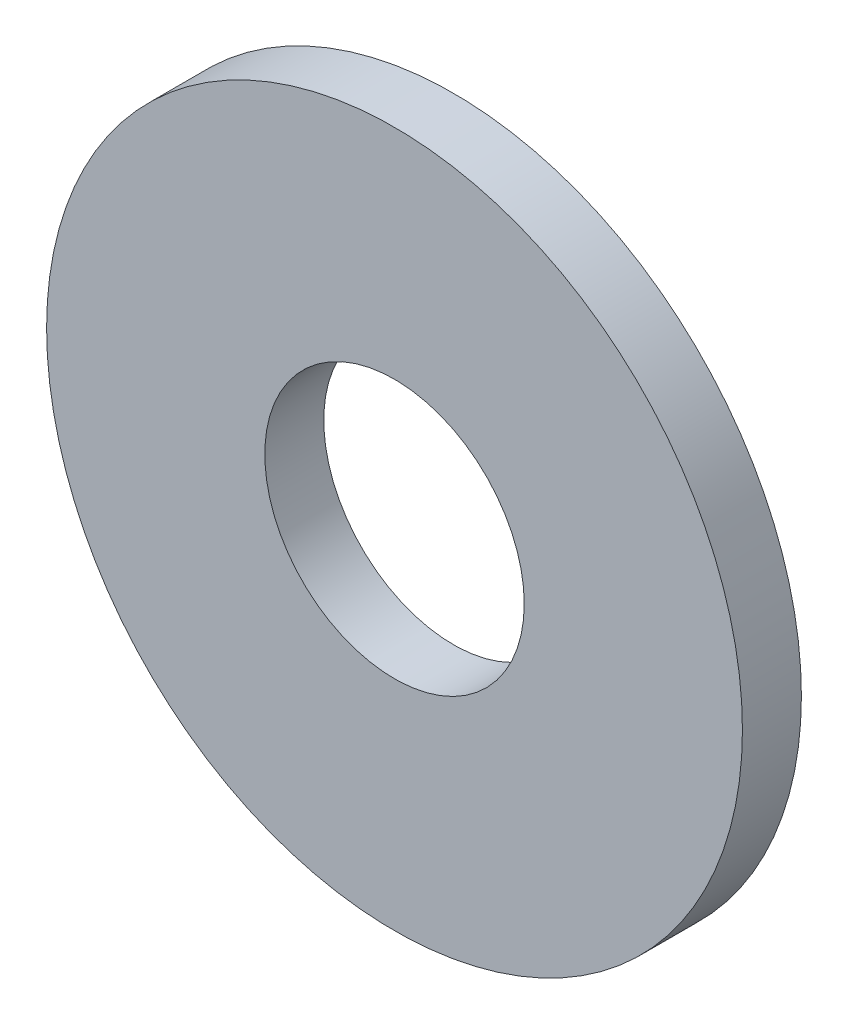
ISO-10303-21;
HEADER;
FILE_DESCRIPTION(('STEP AP214'),'2;1');
FILE_NAME('part.step','',(''),(''),'','','');
FILE_SCHEMA(('AUTOMOTIVE_DESIGN { 1 0 10303 214 1 1 1 1 }'));
ENDSEC;
DATA;
#1=APPLICATION_CONTEXT('core data for automotive mechanical design processes');
#2=APPLICATION_PROTOCOL_DEFINITION('international standard','automotive_design',2000,#1);
#3=PRODUCT_CONTEXT('',#1,'mechanical');
#4=PRODUCT('Part','Part','',(#3));
#5=PRODUCT_RELATED_PRODUCT_CATEGORY('part','',(#4));
#6=PRODUCT_DEFINITION_FORMATION('','',#4);
#7=PRODUCT_DEFINITION_CONTEXT('part definition',#1,'design');
#8=PRODUCT_DEFINITION('design','',#6,#7);
#9=PRODUCT_DEFINITION_SHAPE('','',#8);
#10=(LENGTH_UNIT() NAMED_UNIT(*) SI_UNIT(.MILLI.,.METRE.));
#11=(NAMED_UNIT(*) PLANE_ANGLE_UNIT() SI_UNIT($,.RADIAN.));
#12=(NAMED_UNIT(*) SI_UNIT($,.STERADIAN.) SOLID_ANGLE_UNIT());
#13=UNCERTAINTY_MEASURE_WITH_UNIT(LENGTH_MEASURE(1.E-05),#10,'distance_accuracy_value','');
#14=(GEOMETRIC_REPRESENTATION_CONTEXT(3) GLOBAL_UNCERTAINTY_ASSIGNED_CONTEXT((#13)) GLOBAL_UNIT_ASSIGNED_CONTEXT((#10,
#11,#12)) REPRESENTATION_CONTEXT('',''));
#15=CARTESIAN_POINT('',(0.,0.,0.));
#16=DIRECTION('',(0.,0.,1.));
#17=DIRECTION('',(1.,0.,0.));
#18=AXIS2_PLACEMENT_3D('',#15,#16,#17);
#19=CARTESIAN_POINT('',(0.,0.,0.5));
#20=DIRECTION('',(0.,0.,1.));
#21=DIRECTION('',(1.,0.,0.));
#22=AXIS2_PLACEMENT_3D('',#19,#20,#21);
#23=PLANE('',#22);
#24=CARTESIAN_POINT('',(0.,0.,0.5));
#25=DIRECTION('',(0.,0.,1.));
#26=DIRECTION('',(1.,0.,0.));
#27=AXIS2_PLACEMENT_3D('',#24,#25,#26);
#28=CIRCLE('',#27,5.9);
#29=CARTESIAN_POINT('',(5.9,0.,0.5));
#30=VERTEX_POINT('',#29);
#31=EDGE_CURVE('E10',#30,#30,#28,.T.);
#32=ORIENTED_EDGE('',*,*,#31,.T.);
#33=EDGE_LOOP('',(#32));
#34=FACE_BOUND('',#33,.T.);
#35=CARTESIAN_POINT('',(0.,0.,0.5));
#36=DIRECTION('',(0.,0.,1.));
#37=DIRECTION('',(1.,0.,0.));
#38=AXIS2_PLACEMENT_3D('',#35,#36,#37);
#39=CIRCLE('',#38,2.2);
#40=CARTESIAN_POINT('',(2.2,0.,0.5));
#41=VERTEX_POINT('',#40);
#42=EDGE_CURVE('E43',#41,#41,#39,.T.);
#43=ORIENTED_EDGE('',*,*,#42,.F.);
#44=EDGE_LOOP('',(#43));
#45=FACE_BOUND('',#44,.T.);
#46=ADVANCED_FACE('F32',(#34,#45),#23,.T.);
#47=CARTESIAN_POINT('',(0.,0.,-0.5));
#48=DIRECTION('',(0.,0.,1.));
#49=DIRECTION('',(1.,0.,0.));
#50=AXIS2_PLACEMENT_3D('',#47,#48,#49);
#51=PLANE('',#50);
#52=CARTESIAN_POINT('',(0.,0.,-0.5));
#53=DIRECTION('',(0.,0.,1.));
#54=DIRECTION('',(1.,0.,0.));
#55=AXIS2_PLACEMENT_3D('',#52,#53,#54);
#56=CIRCLE('',#55,5.9);
#57=CARTESIAN_POINT('',(5.9,0.,-0.5));
#58=VERTEX_POINT('',#57);
#59=EDGE_CURVE('E36',#58,#58,#56,.T.);
#60=ORIENTED_EDGE('',*,*,#59,.F.);
#61=EDGE_LOOP('',(#60));
#62=FACE_BOUND('',#61,.T.);
#63=CARTESIAN_POINT('',(0.,0.,-0.5));
#64=DIRECTION('',(0.,0.,1.));
#65=DIRECTION('',(1.,0.,0.));
#66=AXIS2_PLACEMENT_3D('',#63,#64,#65);
#67=CIRCLE('',#66,2.2);
#68=CARTESIAN_POINT('',(2.2,0.,-0.5));
#69=VERTEX_POINT('',#68);
#70=EDGE_CURVE('E45',#69,#69,#67,.T.);
#71=ORIENTED_EDGE('',*,*,#70,.T.);
#72=EDGE_LOOP('',(#71));
#73=FACE_BOUND('',#72,.T.);
#74=ADVANCED_FACE('F55',(#62,#73),#51,.F.);
#75=CARTESIAN_POINT('',(0.,0.,0.5));
#76=DIRECTION('',(0.,0.,-1.));
#77=DIRECTION('',(-1.,0.,0.));
#78=AXIS2_PLACEMENT_3D('',#75,#76,#77);
#79=CYLINDRICAL_SURFACE('',#78,5.9);
#80=ORIENTED_EDGE('',*,*,#31,.F.);
#81=EDGE_LOOP('',(#80));
#82=FACE_BOUND('',#81,.T.);
#83=ORIENTED_EDGE('',*,*,#59,.T.);
#84=EDGE_LOOP('',(#83));
#85=FACE_BOUND('',#84,.T.);
#86=ADVANCED_FACE('F34',(#82,#85),#79,.T.);
#87=CARTESIAN_POINT('',(0.,0.,0.5));
#88=DIRECTION('',(0.,0.,-1.));
#89=DIRECTION('',(-1.,0.,0.));
#90=AXIS2_PLACEMENT_3D('',#87,#88,#89);
#91=CYLINDRICAL_SURFACE('',#90,2.2);
#92=ORIENTED_EDGE('',*,*,#42,.T.);
#93=EDGE_LOOP('',(#92));
#94=FACE_BOUND('',#93,.T.);
#95=ORIENTED_EDGE('',*,*,#70,.F.);
#96=EDGE_LOOP('',(#95));
#97=FACE_BOUND('',#96,.T.);
#98=ADVANCED_FACE('F51',(#94,#97),#91,.F.);
#99=CLOSED_SHELL('',(#46,#74,#86,#98));
#100=MANIFOLD_SOLID_BREP('B2',#99);
#101=ADVANCED_BREP_SHAPE_REPRESENTATION('',(#18,#100),#14);
#102=SHAPE_DEFINITION_REPRESENTATION(#9,#101);
ENDSEC;
END-ISO-10303-21;
